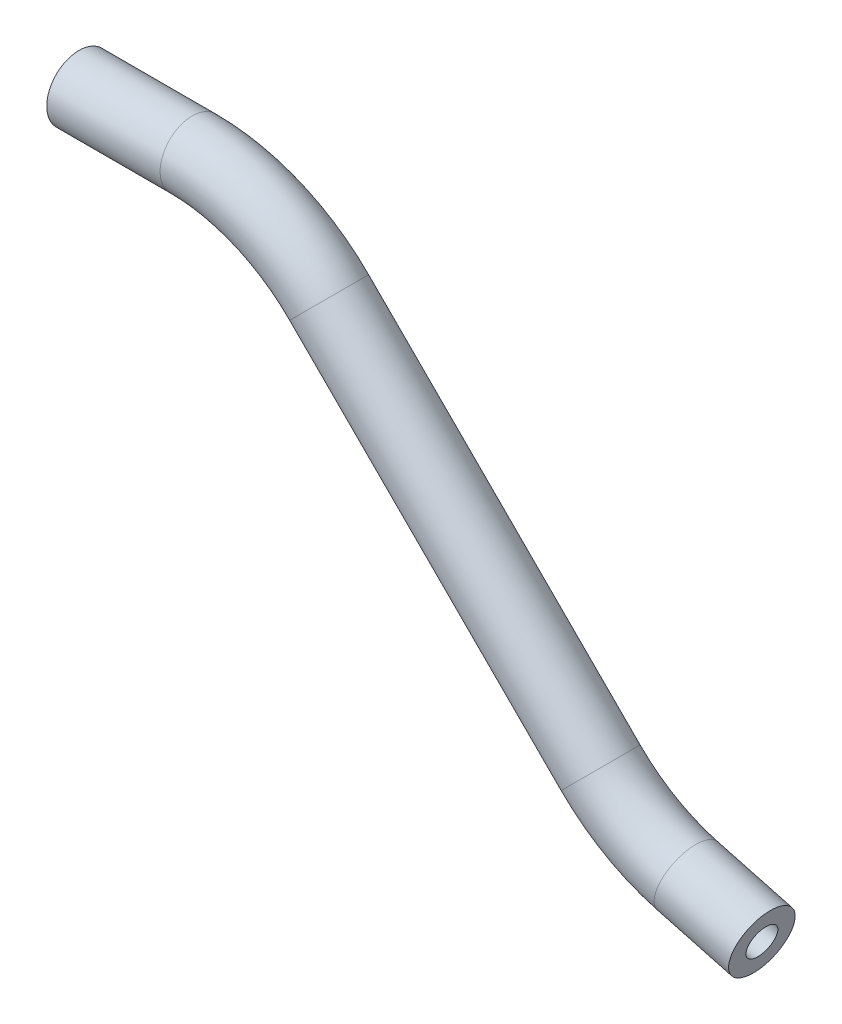
ISO-10303-21;
HEADER;
FILE_DESCRIPTION(('STEP AP214'),'2;1');
FILE_NAME('part.step','',(''),(''),'','','');
FILE_SCHEMA(('AUTOMOTIVE_DESIGN { 1 0 10303 214 1 1 1 1 }'));
ENDSEC;
DATA;
#1=APPLICATION_CONTEXT('core data for automotive mechanical design processes');
#2=APPLICATION_PROTOCOL_DEFINITION('international standard','automotive_design',2000,#1);
#3=PRODUCT_CONTEXT('',#1,'mechanical');
#4=PRODUCT('Part','Part','',(#3));
#5=PRODUCT_RELATED_PRODUCT_CATEGORY('part','',(#4));
#6=PRODUCT_DEFINITION_FORMATION('','',#4);
#7=PRODUCT_DEFINITION_CONTEXT('part definition',#1,'design');
#8=PRODUCT_DEFINITION('design','',#6,#7);
#9=PRODUCT_DEFINITION_SHAPE('','',#8);
#10=(LENGTH_UNIT() NAMED_UNIT(*) SI_UNIT(.MILLI.,.METRE.));
#11=(NAMED_UNIT(*) PLANE_ANGLE_UNIT() SI_UNIT($,.RADIAN.));
#12=(NAMED_UNIT(*) SI_UNIT($,.STERADIAN.) SOLID_ANGLE_UNIT());
#13=UNCERTAINTY_MEASURE_WITH_UNIT(LENGTH_MEASURE(1.E-05),#10,'distance_accuracy_value','');
#14=(GEOMETRIC_REPRESENTATION_CONTEXT(3) GLOBAL_UNCERTAINTY_ASSIGNED_CONTEXT((#13)) GLOBAL_UNIT_ASSIGNED_CONTEXT((#10,
#11,#12)) REPRESENTATION_CONTEXT('',''));
#15=CARTESIAN_POINT('',(0.,0.,0.));
#16=DIRECTION('',(0.,0.,1.));
#17=DIRECTION('',(1.,0.,0.));
#18=AXIS2_PLACEMENT_3D('',#15,#16,#17);
#19=CARTESIAN_POINT('',(0.,0.,0.));
#20=DIRECTION('',(1.,0.,0.));
#21=DIRECTION('',(0.,0.,-1.));
#22=AXIS2_PLACEMENT_3D('',#19,#20,#21);
#23=CYLINDRICAL_SURFACE('',#22,3.175);
#24=CARTESIAN_POINT('',(11.1592316367925,0.,0.));
#25=DIRECTION('',(1.,0.,0.));
#26=DIRECTION('',(0.,0.,-1.));
#27=AXIS2_PLACEMENT_3D('',#24,#25,#26);
#28=CIRCLE('',#27,3.175);
#29=CARTESIAN_POINT('',(11.1592316367925,3.17499999999999,0.));
#30=VERTEX_POINT('',#29);
#31=EDGE_CURVE('E65',#30,#30,#28,.T.);
#32=ORIENTED_EDGE('',*,*,#31,.F.);
#33=EDGE_LOOP('',(#32));
#34=FACE_BOUND('',#33,.T.);
#35=CARTESIAN_POINT('',(0.,0.,0.));
#36=DIRECTION('',(1.,0.,0.));
#37=DIRECTION('',(0.,0.,-1.));
#38=AXIS2_PLACEMENT_3D('',#35,#36,#37);
#39=CIRCLE('',#38,3.175);
#40=CARTESIAN_POINT('',(0.,0.,-3.175));
#41=VERTEX_POINT('',#40);
#42=EDGE_CURVE('E61',#41,#41,#39,.T.);
#43=ORIENTED_EDGE('',*,*,#42,.T.);
#44=EDGE_LOOP('',(#43));
#45=FACE_BOUND('',#44,.T.);
#46=ADVANCED_FACE('F37',(#34,#45),#23,.T.);
#47=CARTESIAN_POINT('',(11.1592316367925,-19.05,0.));
#48=DIRECTION('',(0.,0.,-1.));
#49=DIRECTION('',(-1.,0.,0.));
#50=AXIS2_PLACEMENT_3D('',#47,#48,#49);
#51=TOROIDAL_SURFACE('',#50,19.05,3.175);
#52=CARTESIAN_POINT('',(24.6296158183963,-5.5796158183963,0.));
#53=DIRECTION('',(0.707106781186546,-0.707106781186549,0.));
#54=DIRECTION('',(0.,0.,-1.));
#55=AXIS2_PLACEMENT_3D('',#52,#53,#54);
#56=CIRCLE('',#55,3.175);
#57=CARTESIAN_POINT('',(26.8746798486636,-3.33455178812901,0.));
#58=VERTEX_POINT('',#57);
#59=EDGE_CURVE('E69',#58,#58,#56,.T.);
#60=CARTESIAN_POINT('',(11.1592316367925,-19.05,0.));
#61=DIRECTION('',(0.,0.,-1.));
#62=DIRECTION('',(-1.,0.,0.));
#63=AXIS2_PLACEMENT_3D('',#60,#61,#62);
#64=CIRCLE('',#63,22.225);
#65=EDGE_CURVE('',#30,#58,#64,.T.);
#66=ORIENTED_EDGE('',*,*,#31,.T.);
#67=ORIENTED_EDGE('',*,*,#59,.F.);
#68=ORIENTED_EDGE('',*,*,#65,.T.);
#69=ORIENTED_EDGE('',*,*,#65,.F.);
#70=EDGE_LOOP('',(#66,#68,#67,#69));
#71=FACE_BOUND('',#70,.T.);
#72=ADVANCED_FACE('F91',(#71),#51,.T.);
#73=CARTESIAN_POINT('',(24.6296158183963,-5.5796158183963,0.));
#74=DIRECTION('',(0.707106781186546,-0.707106781186549,0.));
#75=DIRECTION('',(0.707106781186549,0.707106781186546,0.));
#76=AXIS2_PLACEMENT_3D('',#73,#74,#75);
#77=CYLINDRICAL_SURFACE('',#76,3.175);
#78=CARTESIAN_POINT('',(51.3616459210788,-32.3116459210789,0.));
#79=DIRECTION('',(0.707106781186546,-0.707106781186549,0.));
#80=DIRECTION('',(0.,0.,-1.));
#81=AXIS2_PLACEMENT_3D('',#78,#79,#80);
#82=CIRCLE('',#81,3.175);
#83=CARTESIAN_POINT('',(49.1165818908116,-34.5567099513462,0.));
#84=VERTEX_POINT('',#83);
#85=EDGE_CURVE('E72',#84,#84,#82,.T.);
#86=ORIENTED_EDGE('',*,*,#85,.F.);
#87=EDGE_LOOP('',(#86));
#88=FACE_BOUND('',#87,.T.);
#89=ORIENTED_EDGE('',*,*,#59,.T.);
#90=EDGE_LOOP('',(#89));
#91=FACE_BOUND('',#90,.T.);
#92=ADVANCED_FACE('F84',(#88,#91),#77,.T.);
#93=CARTESIAN_POINT('',(64.8320301026826,-18.8412617394752,0.));
#94=DIRECTION('',(0.,0.,1.));
#95=DIRECTION('',(1.,0.,0.));
#96=AXIS2_PLACEMENT_3D('',#93,#94,#95);
#97=TOROIDAL_SURFACE('',#96,19.05,3.175);
#98=CARTESIAN_POINT('',(59.9015272934796,-37.242148730282,0.));
#99=DIRECTION('',(0.965925826289068,-0.258819045102521,0.));
#100=DIRECTION('',(0.,0.,-1.));
#101=AXIS2_PLACEMENT_3D('',#98,#99,#100);
#102=CIRCLE('',#101,3.175);
#103=CARTESIAN_POINT('',(59.0797768252791,-40.3089632287498,0.));
#104=VERTEX_POINT('',#103);
#105=EDGE_CURVE('E41',#104,#104,#102,.T.);
#106=CARTESIAN_POINT('',(64.8320301026826,-18.8412617394752,0.));
#107=DIRECTION('',(0.,0.,1.));
#108=DIRECTION('',(1.,0.,0.));
#109=AXIS2_PLACEMENT_3D('',#106,#107,#108);
#110=CIRCLE('',#109,22.225);
#111=EDGE_CURVE('',#84,#104,#110,.T.);
#112=ORIENTED_EDGE('',*,*,#85,.T.);
#113=ORIENTED_EDGE('',*,*,#105,.F.);
#114=ORIENTED_EDGE('',*,*,#111,.T.);
#115=ORIENTED_EDGE('',*,*,#111,.F.);
#116=EDGE_LOOP('',(#112,#114,#113,#115));
#117=FACE_BOUND('',#116,.T.);
#118=ADVANCED_FACE('F82',(#117),#97,.T.);
#119=CARTESIAN_POINT('',(59.9015272934796,-37.242148730282,0.));
#120=DIRECTION('',(0.965925826289068,-0.258819045102521,0.));
#121=DIRECTION('',(0.258819045102521,0.965925826289068,0.));
#122=AXIS2_PLACEMENT_3D('',#119,#120,#121);
#123=CYLINDRICAL_SURFACE('',#122,3.175);
#124=CARTESIAN_POINT('',(67.2382824781477,-39.2080263570787,0.));
#125=DIRECTION('',(0.965925826289068,-0.258819045102521,0.));
#126=DIRECTION('',(0.,0.,-1.));
#127=AXIS2_PLACEMENT_3D('',#124,#125,#126);
#128=CIRCLE('',#127,3.175);
#129=CARTESIAN_POINT('',(67.2382824781477,-39.2080263570787,-3.175));
#130=VERTEX_POINT('',#129);
#131=EDGE_CURVE('E56',#130,#130,#128,.T.);
#132=ORIENTED_EDGE('',*,*,#131,.F.);
#133=EDGE_LOOP('',(#132));
#134=FACE_BOUND('',#133,.T.);
#135=ORIENTED_EDGE('',*,*,#105,.T.);
#136=EDGE_LOOP('',(#135));
#137=FACE_BOUND('',#136,.T.);
#138=ADVANCED_FACE('F39',(#134,#137),#123,.T.);
#139=CARTESIAN_POINT('',(0.,0.,0.));
#140=DIRECTION('',(1.,0.,0.));
#141=DIRECTION('',(0.,0.,-1.));
#142=AXIS2_PLACEMENT_3D('',#139,#140,#141);
#143=PLANE('',#142);
#144=CARTESIAN_POINT('',(0.,0.,0.));
#145=DIRECTION('',(1.,0.,0.));
#146=DIRECTION('',(0.,0.,-1.));
#147=AXIS2_PLACEMENT_3D('',#144,#145,#146);
#148=CIRCLE('',#147,1.524);
#149=CARTESIAN_POINT('',(0.,0.,-1.524));
#150=VERTEX_POINT('',#149);
#151=EDGE_CURVE('E60',#150,#150,#148,.F.);
#152=ORIENTED_EDGE('',*,*,#151,.F.);
#153=EDGE_LOOP('',(#152));
#154=FACE_BOUND('',#153,.T.);
#155=ORIENTED_EDGE('',*,*,#42,.F.);
#156=EDGE_LOOP('',(#155));
#157=FACE_BOUND('',#156,.T.);
#158=ADVANCED_FACE('F89',(#154,#157),#143,.F.);
#159=CARTESIAN_POINT('',(67.2382824781477,-39.2080263570787,0.));
#160=DIRECTION('',(0.965925826289068,-0.258819045102521,0.));
#161=DIRECTION('',(0.,0.,-1.));
#162=AXIS2_PLACEMENT_3D('',#159,#160,#161);
#163=PLANE('',#162);
#164=CARTESIAN_POINT('',(67.2382824781477,-39.2080263570787,0.));
#165=DIRECTION('',(0.965925826289068,-0.258819045102521,0.));
#166=DIRECTION('',(0.,0.,-1.));
#167=AXIS2_PLACEMENT_3D('',#164,#165,#166);
#168=CIRCLE('',#167,1.524);
#169=CARTESIAN_POINT('',(67.2382824781477,-39.2080263570787,-1.524));
#170=VERTEX_POINT('',#169);
#171=EDGE_CURVE('E10',#170,#170,#168,.F.);
#172=ORIENTED_EDGE('',*,*,#171,.T.);
#173=EDGE_LOOP('',(#172));
#174=FACE_BOUND('',#173,.T.);
#175=ORIENTED_EDGE('',*,*,#131,.T.);
#176=EDGE_LOOP('',(#175));
#177=FACE_BOUND('',#176,.T.);
#178=ADVANCED_FACE('F108',(#174,#177),#163,.T.);
#179=CARTESIAN_POINT('',(0.,0.,0.));
#180=DIRECTION('',(1.,0.,0.));
#181=DIRECTION('',(0.,0.,-1.));
#182=AXIS2_PLACEMENT_3D('',#179,#180,#181);
#183=CYLINDRICAL_SURFACE('',#182,1.524);
#184=CARTESIAN_POINT('',(11.1592316367925,0.,0.));
#185=DIRECTION('',(1.,0.,0.));
#186=DIRECTION('',(0.,0.,-1.));
#187=AXIS2_PLACEMENT_3D('',#184,#185,#186);
#188=CIRCLE('',#187,1.524);
#189=CARTESIAN_POINT('',(11.1592316367925,1.52399999999999,0.));
#190=VERTEX_POINT('',#189);
#191=EDGE_CURVE('E205',#190,#190,#188,.F.);
#192=ORIENTED_EDGE('',*,*,#191,.F.);
#193=EDGE_LOOP('',(#192));
#194=FACE_BOUND('',#193,.T.);
#195=ORIENTED_EDGE('',*,*,#151,.T.);
#196=EDGE_LOOP('',(#195));
#197=FACE_BOUND('',#196,.T.);
#198=ADVANCED_FACE('F111',(#194,#197),#183,.F.);
#199=CARTESIAN_POINT('',(11.1592316367925,-19.05,0.));
#200=DIRECTION('',(0.,0.,-1.));
#201=DIRECTION('',(-1.,0.,0.));
#202=AXIS2_PLACEMENT_3D('',#199,#200,#201);
#203=TOROIDAL_SURFACE('',#202,19.05,1.524);
#204=CARTESIAN_POINT('',(24.6296158183963,-5.5796158183963,0.));
#205=DIRECTION('',(0.707106781186546,-0.707106781186549,0.));
#206=DIRECTION('',(0.,0.,-1.));
#207=AXIS2_PLACEMENT_3D('',#204,#205,#206);
#208=CIRCLE('',#207,1.524);
#209=CARTESIAN_POINT('',(25.7072465529246,-4.501985083868,0.));
#210=VERTEX_POINT('',#209);
#211=EDGE_CURVE('E203',#210,#210,#208,.F.);
#212=CARTESIAN_POINT('',(11.1592316367925,-19.05,0.));
#213=DIRECTION('',(0.,0.,-1.));
#214=DIRECTION('',(-1.,0.,0.));
#215=AXIS2_PLACEMENT_3D('',#212,#213,#214);
#216=CIRCLE('',#215,20.574);
#217=EDGE_CURVE('',#190,#210,#216,.T.);
#218=ORIENTED_EDGE('',*,*,#191,.T.);
#219=ORIENTED_EDGE('',*,*,#211,.F.);
#220=ORIENTED_EDGE('',*,*,#217,.T.);
#221=ORIENTED_EDGE('',*,*,#217,.F.);
#222=EDGE_LOOP('',(#218,#220,#219,#221));
#223=FACE_BOUND('',#222,.T.);
#224=ADVANCED_FACE('F166',(#223),#203,.F.);
#225=CARTESIAN_POINT('',(24.6296158183963,-5.5796158183963,0.));
#226=DIRECTION('',(0.707106781186546,-0.707106781186549,0.));
#227=DIRECTION('',(0.707106781186549,0.707106781186546,0.));
#228=AXIS2_PLACEMENT_3D('',#225,#226,#227);
#229=CYLINDRICAL_SURFACE('',#228,1.524);
#230=CARTESIAN_POINT('',(51.3616459210788,-32.3116459210789,0.));
#231=DIRECTION('',(0.707106781186546,-0.707106781186549,0.));
#232=DIRECTION('',(0.,0.,-1.));
#233=AXIS2_PLACEMENT_3D('',#230,#231,#232);
#234=CIRCLE('',#233,1.524);
#235=CARTESIAN_POINT('',(50.2840151865505,-33.3892766556073,0.));
#236=VERTEX_POINT('',#235);
#237=EDGE_CURVE('E52',#236,#236,#234,.F.);
#238=ORIENTED_EDGE('',*,*,#237,.F.);
#239=EDGE_LOOP('',(#238));
#240=FACE_BOUND('',#239,.T.);
#241=ORIENTED_EDGE('',*,*,#211,.T.);
#242=EDGE_LOOP('',(#241));
#243=FACE_BOUND('',#242,.T.);
#244=ADVANCED_FACE('F102',(#240,#243),#229,.F.);
#245=CARTESIAN_POINT('',(64.8320301026826,-18.8412617394752,0.));
#246=DIRECTION('',(0.,0.,1.));
#247=DIRECTION('',(1.,0.,0.));
#248=AXIS2_PLACEMENT_3D('',#245,#246,#247);
#249=TOROIDAL_SURFACE('',#248,19.05,1.524);
#250=CARTESIAN_POINT('',(59.9015272934796,-37.242148730282,0.));
#251=DIRECTION('',(0.965925826289068,-0.258819045102521,0.));
#252=DIRECTION('',(0.,0.,-1.));
#253=AXIS2_PLACEMENT_3D('',#250,#251,#252);
#254=CIRCLE('',#253,1.524);
#255=CARTESIAN_POINT('',(59.5070870687433,-38.7142196895465,0.));
#256=VERTEX_POINT('',#255);
#257=EDGE_CURVE('E46',#256,#256,#254,.F.);
#258=CARTESIAN_POINT('',(64.8320301026826,-18.8412617394752,0.));
#259=DIRECTION('',(0.,0.,1.));
#260=DIRECTION('',(1.,0.,0.));
#261=AXIS2_PLACEMENT_3D('',#258,#259,#260);
#262=CIRCLE('',#261,20.574);
#263=EDGE_CURVE('',#236,#256,#262,.T.);
#264=ORIENTED_EDGE('',*,*,#237,.T.);
#265=ORIENTED_EDGE('',*,*,#257,.F.);
#266=ORIENTED_EDGE('',*,*,#263,.T.);
#267=ORIENTED_EDGE('',*,*,#263,.F.);
#268=EDGE_LOOP('',(#264,#266,#265,#267));
#269=FACE_BOUND('',#268,.T.);
#270=ADVANCED_FACE('F96',(#269),#249,.F.);
#271=CARTESIAN_POINT('',(59.9015272934796,-37.242148730282,0.));
#272=DIRECTION('',(0.965925826289068,-0.258819045102521,0.));
#273=DIRECTION('',(0.258819045102521,0.965925826289068,0.));
#274=AXIS2_PLACEMENT_3D('',#271,#272,#273);
#275=CYLINDRICAL_SURFACE('',#274,1.524);
#276=ORIENTED_EDGE('',*,*,#171,.F.);
#277=EDGE_LOOP('',(#276));
#278=FACE_BOUND('',#277,.T.);
#279=ORIENTED_EDGE('',*,*,#257,.T.);
#280=EDGE_LOOP('',(#279));
#281=FACE_BOUND('',#280,.T.);
#282=ADVANCED_FACE('F94',(#278,#281),#275,.F.);
#283=CLOSED_SHELL('',(#46,#72,#92,#118,#138,#158,#178,#198,#224,#244,#270,#282));
#284=MANIFOLD_SOLID_BREP('B2',#283);
#285=ADVANCED_BREP_SHAPE_REPRESENTATION('',(#18,#284),#14);
#286=SHAPE_DEFINITION_REPRESENTATION(#9,#285);
ENDSEC;
END-ISO-10303-21;
